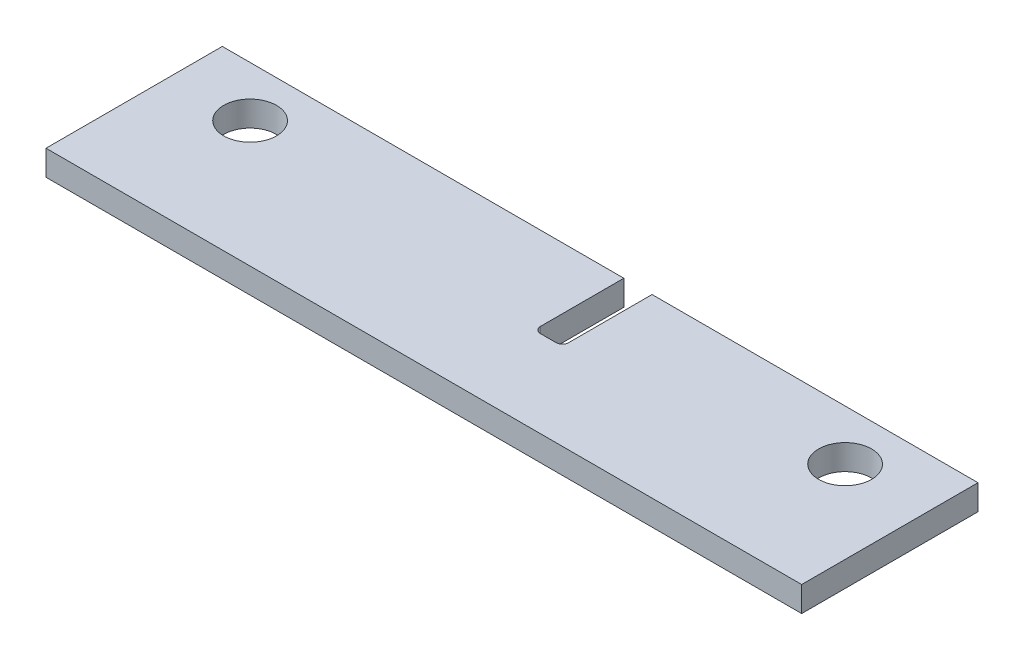
ISO-10303-21;
HEADER;
FILE_DESCRIPTION(('STEP AP214'),'2;1');
FILE_NAME('part.step','',(''),(''),'','','');
FILE_SCHEMA(('AUTOMOTIVE_DESIGN { 1 0 10303 214 1 1 1 1 }'));
ENDSEC;
DATA;
#1=APPLICATION_CONTEXT('core data for automotive mechanical design processes');
#2=APPLICATION_PROTOCOL_DEFINITION('international standard','automotive_design',2000,#1);
#3=PRODUCT_CONTEXT('',#1,'mechanical');
#4=PRODUCT('Part','Part','',(#3));
#5=PRODUCT_RELATED_PRODUCT_CATEGORY('part','',(#4));
#6=PRODUCT_DEFINITION_FORMATION('','',#4);
#7=PRODUCT_DEFINITION_CONTEXT('part definition',#1,'design');
#8=PRODUCT_DEFINITION('design','',#6,#7);
#9=PRODUCT_DEFINITION_SHAPE('','',#8);
#10=(LENGTH_UNIT() NAMED_UNIT(*) SI_UNIT(.MILLI.,.METRE.));
#11=(NAMED_UNIT(*) PLANE_ANGLE_UNIT() SI_UNIT($,.RADIAN.));
#12=(NAMED_UNIT(*) SI_UNIT($,.STERADIAN.) SOLID_ANGLE_UNIT());
#13=UNCERTAINTY_MEASURE_WITH_UNIT(LENGTH_MEASURE(1.E-05),#10,'distance_accuracy_value','');
#14=(GEOMETRIC_REPRESENTATION_CONTEXT(3) GLOBAL_UNCERTAINTY_ASSIGNED_CONTEXT((#13)) GLOBAL_UNIT_ASSIGNED_CONTEXT((#10,
#11,#12)) REPRESENTATION_CONTEXT('',''));
#15=CARTESIAN_POINT('',(0.,0.,0.));
#16=DIRECTION('',(0.,0.,1.));
#17=DIRECTION('',(1.,0.,0.));
#18=AXIS2_PLACEMENT_3D('',#15,#16,#17);
#19=CARTESIAN_POINT('',(0.,0.,249.6));
#20=DIRECTION('',(0.,0.,1.));
#21=DIRECTION('',(1.,0.,0.));
#22=AXIS2_PLACEMENT_3D('',#19,#20,#21);
#23=PLANE('',#22);
#24=DIRECTION('',(-1.,0.,0.));
#25=VECTOR('',#24,1.);
#26=CARTESIAN_POINT('',(2260.6,65.,249.6));
#27=LINE('',#26,#25);
#28=CARTESIAN_POINT('',(2463.038,65.,249.6));
#29=VERTEX_POINT('',#28);
#30=CARTESIAN_POINT('',(2260.6,65.,249.6));
#31=VERTEX_POINT('',#30);
#32=EDGE_CURVE('E127',#29,#31,#27,.T.);
#33=ORIENTED_EDGE('',*,*,#32,.F.);
#34=DIRECTION('',(0.,1.,0.));
#35=VECTOR('',#34,1.);
#36=CARTESIAN_POINT('',(2463.038,52.3,249.6));
#37=LINE('',#36,#35);
#38=CARTESIAN_POINT('',(2463.038,52.3,249.6));
#39=VERTEX_POINT('',#38);
#40=EDGE_CURVE('E194',#39,#29,#37,.T.);
#41=ORIENTED_EDGE('',*,*,#40,.F.);
#42=DIRECTION('',(1.,0.,0.));
#43=VECTOR('',#42,1.);
#44=CARTESIAN_POINT('',(2260.6,52.3,249.6));
#45=LINE('',#44,#43);
#46=CARTESIAN_POINT('',(2260.6,52.3,249.6));
#47=VERTEX_POINT('',#46);
#48=EDGE_CURVE('E152',#47,#39,#45,.T.);
#49=ORIENTED_EDGE('',*,*,#48,.F.);
#50=DIRECTION('',(0.,-1.,0.));
#51=VECTOR('',#50,1.);
#52=CARTESIAN_POINT('',(2260.6,65.,249.6));
#53=LINE('',#52,#51);
#54=EDGE_CURVE('E145',#31,#47,#53,.T.);
#55=ORIENTED_EDGE('',*,*,#54,.F.);
#56=EDGE_LOOP('',(#33,#41,#49,#55));
#57=FACE_BOUND('',#56,.T.);
#58=ADVANCED_FACE('F48',(#57),#23,.F.);
#59=CARTESIAN_POINT('',(2260.6,65.,249.6));
#60=DIRECTION('',(-1.,0.,0.));
#61=DIRECTION('',(0.,0.,1.));
#62=AXIS2_PLACEMENT_3D('',#59,#60,#61);
#63=PLANE('',#62);
#64=DIRECTION('',(0.,0.,1.));
#65=VECTOR('',#64,1.);
#66=CARTESIAN_POINT('',(2260.6,52.3,249.6));
#67=LINE('',#66,#65);
#68=CARTESIAN_POINT('',(2260.6,52.3,338.5));
#69=VERTEX_POINT('',#68);
#70=EDGE_CURVE('E155',#47,#69,#67,.T.);
#71=ORIENTED_EDGE('',*,*,#70,.T.);
#72=DIRECTION('',(0.,-1.,0.));
#73=VECTOR('',#72,1.);
#74=CARTESIAN_POINT('',(2260.6,65.,338.5));
#75=LINE('',#74,#73);
#76=CARTESIAN_POINT('',(2260.6,65.,338.5));
#77=VERTEX_POINT('',#76);
#78=EDGE_CURVE('E147',#77,#69,#75,.T.);
#79=ORIENTED_EDGE('',*,*,#78,.F.);
#80=DIRECTION('',(0.,0.,1.));
#81=VECTOR('',#80,1.);
#82=CARTESIAN_POINT('',(2260.6,65.,249.6));
#83=LINE('',#82,#81);
#84=EDGE_CURVE('E131',#31,#77,#83,.T.);
#85=ORIENTED_EDGE('',*,*,#84,.F.);
#86=ORIENTED_EDGE('',*,*,#54,.T.);
#87=EDGE_LOOP('',(#71,#79,#85,#86));
#88=FACE_BOUND('',#87,.T.);
#89=ADVANCED_FACE('F144',(#88),#63,.T.);
#90=CARTESIAN_POINT('',(2260.6,65.,249.6));
#91=DIRECTION('',(0.,1.,0.));
#92=DIRECTION('',(0.,0.,1.));
#93=AXIS2_PLACEMENT_3D('',#90,#91,#92);
#94=PLANE('',#93);
#95=CARTESIAN_POINT('',(2599.99999999996,65.,275.));
#96=DIRECTION('',(0.,1.,0.));
#97=DIRECTION('',(0.,0.,1.));
#98=AXIS2_PLACEMENT_3D('',#95,#96,#97);
#99=CIRCLE('',#98,13.3349999999999);
#100=CARTESIAN_POINT('',(2599.99999999996,64.9999999999999,261.665));
#101=VERTEX_POINT('',#100);
#102=EDGE_CURVE('E154',#101,#101,#99,.F.);
#103=ORIENTED_EDGE('',*,*,#102,.T.);
#104=EDGE_LOOP('',(#103));
#105=FACE_BOUND('',#104,.T.);
#106=CARTESIAN_POINT('',(2299.99999999996,65.,275.));
#107=DIRECTION('',(0.,1.,0.));
#108=DIRECTION('',(0.,0.,1.));
#109=AXIS2_PLACEMENT_3D('',#106,#107,#108);
#110=CIRCLE('',#109,13.3349999999999);
#111=CARTESIAN_POINT('',(2299.99999999996,65.,261.665));
#112=VERTEX_POINT('',#111);
#113=EDGE_CURVE('E138',#112,#112,#110,.F.);
#114=ORIENTED_EDGE('',*,*,#113,.T.);
#115=EDGE_LOOP('',(#114));
#116=FACE_BOUND('',#115,.T.);
#117=DIRECTION('',(0.,0.,1.));
#118=VECTOR('',#117,1.);
#119=CARTESIAN_POINT('',(2463.038,65.,249.6));
#120=LINE('',#119,#118);
#121=CARTESIAN_POINT('',(2463.038,65.,291.637));
#122=VERTEX_POINT('',#121);
#123=EDGE_CURVE('E133',#29,#122,#120,.T.);
#124=ORIENTED_EDGE('',*,*,#123,.F.);
#125=ORIENTED_EDGE('',*,*,#32,.T.);
#126=ORIENTED_EDGE('',*,*,#84,.T.);
#127=DIRECTION('',(-1.,0.,0.));
#128=VECTOR('',#127,1.);
#129=CARTESIAN_POINT('',(2260.6,65.,338.5));
#130=LINE('',#129,#128);
#131=CARTESIAN_POINT('',(2641.6,65.,338.5));
#132=VERTEX_POINT('',#131);
#133=EDGE_CURVE('E165',#132,#77,#130,.T.);
#134=ORIENTED_EDGE('',*,*,#133,.F.);
#135=DIRECTION('',(0.,0.,1.));
#136=VECTOR('',#135,1.);
#137=CARTESIAN_POINT('',(2641.6,65.,249.6));
#138=LINE('',#137,#136);
#139=CARTESIAN_POINT('',(2641.6,65.,249.6));
#140=VERTEX_POINT('',#139);
#141=EDGE_CURVE('E244',#140,#132,#138,.T.);
#142=ORIENTED_EDGE('',*,*,#141,.F.);
#143=CARTESIAN_POINT('',(2477.262,65.,249.6));
#144=VERTEX_POINT('',#143);
#145=EDGE_CURVE('E140',#140,#144,#27,.T.);
#146=ORIENTED_EDGE('',*,*,#145,.T.);
#147=DIRECTION('',(0.,0.,-1.));
#148=VECTOR('',#147,1.);
#149=CARTESIAN_POINT('',(2477.262,65.,249.6));
#150=LINE('',#149,#148);
#151=CARTESIAN_POINT('',(2477.262,65.,291.637));
#152=VERTEX_POINT('',#151);
#153=EDGE_CURVE('E197',#152,#144,#150,.T.);
#154=ORIENTED_EDGE('',*,*,#153,.F.);
#155=CARTESIAN_POINT('',(2474.087,65.,291.637));
#156=DIRECTION('',(0.,1.,0.));
#157=DIRECTION('',(0.,0.,1.));
#158=AXIS2_PLACEMENT_3D('',#155,#156,#157);
#159=CIRCLE('',#158,3.175);
#160=CARTESIAN_POINT('',(2474.087,65.,294.812));
#161=VERTEX_POINT('',#160);
#162=EDGE_CURVE('E230',#152,#161,#159,.F.);
#163=ORIENTED_EDGE('',*,*,#162,.T.);
#164=DIRECTION('',(1.,0.,0.));
#165=VECTOR('',#164,1.);
#166=CARTESIAN_POINT('',(2260.6,65.,294.812));
#167=LINE('',#166,#165);
#168=CARTESIAN_POINT('',(2466.213,65.,294.812));
#169=VERTEX_POINT('',#168);
#170=EDGE_CURVE('E213',#169,#161,#167,.T.);
#171=ORIENTED_EDGE('',*,*,#170,.F.);
#172=CARTESIAN_POINT('',(2466.213,65.,291.637));
#173=DIRECTION('',(0.,1.,0.));
#174=DIRECTION('',(0.,0.,1.));
#175=AXIS2_PLACEMENT_3D('',#172,#173,#174);
#176=CIRCLE('',#175,3.175);
#177=EDGE_CURVE('E57',#169,#122,#176,.F.);
#178=ORIENTED_EDGE('',*,*,#177,.T.);
#179=EDGE_LOOP('',(#124,#125,#126,#134,#142,#146,#154,#163,#171,#178));
#180=FACE_BOUND('',#179,.T.);
#181=ADVANCED_FACE('F129',(#105,#116,#180),#94,.T.);
#182=CARTESIAN_POINT('',(2641.6,65.,249.6));
#183=DIRECTION('',(1.,0.,0.));
#184=DIRECTION('',(0.,0.,-1.));
#185=AXIS2_PLACEMENT_3D('',#182,#183,#184);
#186=PLANE('',#185);
#187=ORIENTED_EDGE('',*,*,#141,.T.);
#188=DIRECTION('',(0.,1.,0.));
#189=VECTOR('',#188,1.);
#190=CARTESIAN_POINT('',(2641.6,65.,338.5));
#191=LINE('',#190,#189);
#192=CARTESIAN_POINT('',(2641.6,52.3,338.5));
#193=VERTEX_POINT('',#192);
#194=EDGE_CURVE('E168',#193,#132,#191,.T.);
#195=ORIENTED_EDGE('',*,*,#194,.F.);
#196=DIRECTION('',(0.,0.,1.));
#197=VECTOR('',#196,1.);
#198=CARTESIAN_POINT('',(2641.6,52.3,249.6));
#199=LINE('',#198,#197);
#200=CARTESIAN_POINT('',(2641.6,52.3,249.6));
#201=VERTEX_POINT('',#200);
#202=EDGE_CURVE('E238',#201,#193,#199,.T.);
#203=ORIENTED_EDGE('',*,*,#202,.F.);
#204=DIRECTION('',(0.,1.,0.));
#205=VECTOR('',#204,1.);
#206=CARTESIAN_POINT('',(2641.6,65.,249.6));
#207=LINE('',#206,#205);
#208=EDGE_CURVE('E184',#201,#140,#207,.T.);
#209=ORIENTED_EDGE('',*,*,#208,.T.);
#210=EDGE_LOOP('',(#187,#195,#203,#209));
#211=FACE_BOUND('',#210,.T.);
#212=ADVANCED_FACE('F295',(#211),#186,.T.);
#213=CARTESIAN_POINT('',(2260.6,52.3,249.6));
#214=DIRECTION('',(0.,-1.,0.));
#215=DIRECTION('',(0.,0.,-1.));
#216=AXIS2_PLACEMENT_3D('',#213,#214,#215);
#217=PLANE('',#216);
#218=CARTESIAN_POINT('',(2599.99999999996,52.3,275.));
#219=DIRECTION('',(0.,-1.,0.));
#220=DIRECTION('',(0.,0.,-1.));
#221=AXIS2_PLACEMENT_3D('',#218,#219,#220);
#222=CIRCLE('',#221,13.3349999999999);
#223=CARTESIAN_POINT('',(2599.99999999996,52.3,261.665));
#224=VERTEX_POINT('',#223);
#225=EDGE_CURVE('E179',#224,#224,#222,.F.);
#226=ORIENTED_EDGE('',*,*,#225,.T.);
#227=EDGE_LOOP('',(#226));
#228=FACE_BOUND('',#227,.T.);
#229=CARTESIAN_POINT('',(2299.99999999996,52.3,275.));
#230=DIRECTION('',(0.,-1.,0.));
#231=DIRECTION('',(0.,0.,-1.));
#232=AXIS2_PLACEMENT_3D('',#229,#230,#231);
#233=CIRCLE('',#232,13.3349999999999);
#234=CARTESIAN_POINT('',(2299.99999999996,52.3,261.665));
#235=VERTEX_POINT('',#234);
#236=EDGE_CURVE('E183',#235,#235,#233,.F.);
#237=ORIENTED_EDGE('',*,*,#236,.T.);
#238=EDGE_LOOP('',(#237));
#239=FACE_BOUND('',#238,.T.);
#240=DIRECTION('',(0.,0.,1.));
#241=VECTOR('',#240,1.);
#242=CARTESIAN_POINT('',(2463.038,52.3,249.6));
#243=LINE('',#242,#241);
#244=CARTESIAN_POINT('',(2463.038,52.3,291.637));
#245=VERTEX_POINT('',#244);
#246=EDGE_CURVE('E191',#39,#245,#243,.T.);
#247=ORIENTED_EDGE('',*,*,#246,.T.);
#248=CARTESIAN_POINT('',(2466.213,52.3,291.637));
#249=DIRECTION('',(0.,-1.,0.));
#250=DIRECTION('',(0.,0.,-1.));
#251=AXIS2_PLACEMENT_3D('',#248,#249,#250);
#252=CIRCLE('',#251,3.175);
#253=CARTESIAN_POINT('',(2466.213,52.3,294.812));
#254=VERTEX_POINT('',#253);
#255=EDGE_CURVE('E12',#245,#254,#252,.F.);
#256=ORIENTED_EDGE('',*,*,#255,.T.);
#257=DIRECTION('',(1.,0.,0.));
#258=VECTOR('',#257,1.);
#259=CARTESIAN_POINT('',(2463.8,52.3,294.812));
#260=LINE('',#259,#258);
#261=CARTESIAN_POINT('',(2474.087,52.3,294.812));
#262=VERTEX_POINT('',#261);
#263=EDGE_CURVE('E200',#254,#262,#260,.T.);
#264=ORIENTED_EDGE('',*,*,#263,.T.);
#265=CARTESIAN_POINT('',(2474.087,52.3,291.637));
#266=DIRECTION('',(0.,-1.,0.));
#267=DIRECTION('',(0.,0.,-1.));
#268=AXIS2_PLACEMENT_3D('',#265,#266,#267);
#269=CIRCLE('',#268,3.175);
#270=CARTESIAN_POINT('',(2477.262,52.3,291.637));
#271=VERTEX_POINT('',#270);
#272=EDGE_CURVE('E233',#262,#271,#269,.F.);
#273=ORIENTED_EDGE('',*,*,#272,.T.);
#274=DIRECTION('',(0.,0.,-1.));
#275=VECTOR('',#274,1.);
#276=CARTESIAN_POINT('',(2477.262,52.3,249.6));
#277=LINE('',#276,#275);
#278=CARTESIAN_POINT('',(2477.262,52.3,249.6));
#279=VERTEX_POINT('',#278);
#280=EDGE_CURVE('E204',#271,#279,#277,.T.);
#281=ORIENTED_EDGE('',*,*,#280,.T.);
#282=EDGE_CURVE('E207',#279,#201,#45,.T.);
#283=ORIENTED_EDGE('',*,*,#282,.T.);
#284=ORIENTED_EDGE('',*,*,#202,.T.);
#285=DIRECTION('',(1.,0.,0.));
#286=VECTOR('',#285,1.);
#287=CARTESIAN_POINT('',(2260.6,52.3,338.5));
#288=LINE('',#287,#286);
#289=EDGE_CURVE('E172',#69,#193,#288,.T.);
#290=ORIENTED_EDGE('',*,*,#289,.F.);
#291=ORIENTED_EDGE('',*,*,#70,.F.);
#292=ORIENTED_EDGE('',*,*,#48,.T.);
#293=EDGE_LOOP('',(#247,#256,#264,#273,#281,#283,#284,#290,#291,#292));
#294=FACE_BOUND('',#293,.T.);
#295=ADVANCED_FACE('F270',(#228,#239,#294),#217,.T.);
#296=ORIENTED_EDGE('',*,*,#282,.F.);
#297=DIRECTION('',(0.,1.,0.));
#298=VECTOR('',#297,1.);
#299=CARTESIAN_POINT('',(2477.262,0.,249.6));
#300=LINE('',#299,#298);
#301=EDGE_CURVE('E177',#279,#144,#300,.T.);
#302=ORIENTED_EDGE('',*,*,#301,.T.);
#303=ORIENTED_EDGE('',*,*,#145,.F.);
#304=ORIENTED_EDGE('',*,*,#208,.F.);
#305=EDGE_LOOP('',(#296,#302,#303,#304));
#306=FACE_BOUND('',#305,.T.);
#307=ADVANCED_FACE('F253',(#306),#23,.F.);
#308=CARTESIAN_POINT('',(0.,0.,338.5));
#309=DIRECTION('',(0.,0.,1.));
#310=DIRECTION('',(1.,0.,0.));
#311=AXIS2_PLACEMENT_3D('',#308,#309,#310);
#312=PLANE('',#311);
#313=ORIENTED_EDGE('',*,*,#78,.T.);
#314=ORIENTED_EDGE('',*,*,#289,.T.);
#315=ORIENTED_EDGE('',*,*,#194,.T.);
#316=ORIENTED_EDGE('',*,*,#133,.T.);
#317=EDGE_LOOP('',(#313,#314,#315,#316));
#318=FACE_BOUND('',#317,.T.);
#319=ADVANCED_FACE('F273',(#318),#312,.T.);
#320=CARTESIAN_POINT('',(2463.038,52.3,249.6));
#321=DIRECTION('',(-1.,0.,0.));
#322=DIRECTION('',(0.,0.,1.));
#323=AXIS2_PLACEMENT_3D('',#320,#321,#322);
#324=PLANE('',#323);
#325=ORIENTED_EDGE('',*,*,#123,.T.);
#326=DIRECTION('',(0.,1.,0.));
#327=VECTOR('',#326,1.);
#328=CARTESIAN_POINT('',(2463.038,52.3,291.637));
#329=LINE('',#328,#327);
#330=EDGE_CURVE('E67',#122,#245,#329,.F.);
#331=ORIENTED_EDGE('',*,*,#330,.T.);
#332=ORIENTED_EDGE('',*,*,#246,.F.);
#333=ORIENTED_EDGE('',*,*,#40,.T.);
#334=EDGE_LOOP('',(#325,#331,#332,#333));
#335=FACE_BOUND('',#334,.T.);
#336=ADVANCED_FACE('F271',(#335),#324,.F.);
#337=CARTESIAN_POINT('',(2477.262,52.3,249.6));
#338=DIRECTION('',(1.,0.,0.));
#339=DIRECTION('',(0.,0.,-1.));
#340=AXIS2_PLACEMENT_3D('',#337,#338,#339);
#341=PLANE('',#340);
#342=ORIENTED_EDGE('',*,*,#280,.F.);
#343=DIRECTION('',(0.,1.,0.));
#344=VECTOR('',#343,1.);
#345=CARTESIAN_POINT('',(2477.262,65.,291.637));
#346=LINE('',#345,#344);
#347=EDGE_CURVE('E217',#271,#152,#346,.T.);
#348=ORIENTED_EDGE('',*,*,#347,.T.);
#349=ORIENTED_EDGE('',*,*,#153,.T.);
#350=ORIENTED_EDGE('',*,*,#301,.F.);
#351=EDGE_LOOP('',(#342,#348,#349,#350));
#352=FACE_BOUND('',#351,.T.);
#353=ADVANCED_FACE('F257',(#352),#341,.F.);
#354=CARTESIAN_POINT('',(2463.8,52.3,294.812));
#355=DIRECTION('',(0.,0.,1.));
#356=DIRECTION('',(1.,0.,0.));
#357=AXIS2_PLACEMENT_3D('',#354,#355,#356);
#358=PLANE('',#357);
#359=ORIENTED_EDGE('',*,*,#170,.T.);
#360=DIRECTION('',(0.,1.,0.));
#361=VECTOR('',#360,1.);
#362=CARTESIAN_POINT('',(2474.087,52.3,294.812));
#363=LINE('',#362,#361);
#364=EDGE_CURVE('E225',#161,#262,#363,.F.);
#365=ORIENTED_EDGE('',*,*,#364,.T.);
#366=ORIENTED_EDGE('',*,*,#263,.F.);
#367=DIRECTION('',(0.,1.,0.));
#368=VECTOR('',#367,1.);
#369=CARTESIAN_POINT('',(2466.213,65.,294.812));
#370=LINE('',#369,#368);
#371=EDGE_CURVE('E221',#254,#169,#370,.T.);
#372=ORIENTED_EDGE('',*,*,#371,.T.);
#373=EDGE_LOOP('',(#359,#365,#366,#372));
#374=FACE_BOUND('',#373,.T.);
#375=ADVANCED_FACE('F264',(#374),#358,.F.);
#376=CARTESIAN_POINT('',(2299.99999999996,181.249999999996,275.));
#377=DIRECTION('',(0.,-1.,0.));
#378=DIRECTION('',(0.,0.,-1.));
#379=AXIS2_PLACEMENT_3D('',#376,#377,#378);
#380=CYLINDRICAL_SURFACE('',#379,13.3349999999999);
#381=CARTESIAN_POINT('',(2299.99999999996,65.,261.665));
#382=CARTESIAN_POINT('',(2299.99999999996,64.8677083333333,261.665));
#383=CARTESIAN_POINT('',(2299.99999999996,64.7354166666666,261.665));
#384=CARTESIAN_POINT('',(2299.99999999996,64.4708333333333,261.665));
#385=CARTESIAN_POINT('',(2299.99999999996,64.3385416666666,261.665));
#386=CARTESIAN_POINT('',(2299.99999999996,64.0739583333333,261.665));
#387=CARTESIAN_POINT('',(2299.99999999996,63.9416666666666,261.665));
#388=CARTESIAN_POINT('',(2299.99999999996,63.6770833333333,261.665));
#389=CARTESIAN_POINT('',(2299.99999999996,63.5447916666666,261.665));
#390=CARTESIAN_POINT('',(2299.99999999996,63.2802083333333,261.665));
#391=CARTESIAN_POINT('',(2299.99999999996,63.1479166666666,261.665));
#392=CARTESIAN_POINT('',(2299.99999999996,62.8833333333333,261.665));
#393=CARTESIAN_POINT('',(2299.99999999996,62.7510416666666,261.665));
#394=CARTESIAN_POINT('',(2299.99999999996,62.4864583333333,261.665));
#395=CARTESIAN_POINT('',(2299.99999999996,62.3541666666666,261.665));
#396=CARTESIAN_POINT('',(2299.99999999996,62.0895833333333,261.665));
#397=CARTESIAN_POINT('',(2299.99999999996,61.9572916666666,261.665));
#398=CARTESIAN_POINT('',(2299.99999999996,61.6927083333333,261.665));
#399=CARTESIAN_POINT('',(2299.99999999996,61.5604166666666,261.665));
#400=CARTESIAN_POINT('',(2299.99999999996,61.2958333333333,261.665));
#401=CARTESIAN_POINT('',(2299.99999999996,61.1635416666666,261.665));
#402=CARTESIAN_POINT('',(2299.99999999996,60.8989583333333,261.665));
#403=CARTESIAN_POINT('',(2299.99999999996,60.7666666666666,261.665));
#404=CARTESIAN_POINT('',(2299.99999999996,60.5020833333333,261.665));
#405=CARTESIAN_POINT('',(2299.99999999996,60.3697916666666,261.665));
#406=CARTESIAN_POINT('',(2299.99999999996,60.1052083333333,261.665));
#407=CARTESIAN_POINT('',(2299.99999999996,59.9729166666666,261.665));
#408=CARTESIAN_POINT('',(2299.99999999996,59.7083333333333,261.665));
#409=CARTESIAN_POINT('',(2299.99999999996,59.5760416666666,261.665));
#410=CARTESIAN_POINT('',(2299.99999999996,59.3114583333333,261.665));
#411=CARTESIAN_POINT('',(2299.99999999996,59.1791666666666,261.665));
#412=CARTESIAN_POINT('',(2299.99999999996,58.9145833333333,261.665));
#413=CARTESIAN_POINT('',(2299.99999999996,58.7822916666666,261.665));
#414=CARTESIAN_POINT('',(2299.99999999996,58.5177083333333,261.665));
#415=CARTESIAN_POINT('',(2299.99999999996,58.3854166666666,261.665));
#416=CARTESIAN_POINT('',(2299.99999999996,58.1208333333333,261.665));
#417=CARTESIAN_POINT('',(2299.99999999996,57.9885416666666,261.665));
#418=CARTESIAN_POINT('',(2299.99999999996,57.7239583333333,261.665));
#419=CARTESIAN_POINT('',(2299.99999999996,57.5916666666666,261.665));
#420=CARTESIAN_POINT('',(2299.99999999996,57.3270833333333,261.665));
#421=CARTESIAN_POINT('',(2299.99999999996,57.1947916666666,261.665));
#422=CARTESIAN_POINT('',(2299.99999999996,56.9302083333333,261.665));
#423=CARTESIAN_POINT('',(2299.99999999996,56.7979166666666,261.665));
#424=CARTESIAN_POINT('',(2299.99999999996,56.5333333333333,261.665));
#425=CARTESIAN_POINT('',(2299.99999999996,56.4010416666666,261.665));
#426=CARTESIAN_POINT('',(2299.99999999996,56.1364583333333,261.665));
#427=CARTESIAN_POINT('',(2299.99999999996,56.0041666666666,261.665));
#428=CARTESIAN_POINT('',(2299.99999999996,55.7395833333333,261.665));
#429=CARTESIAN_POINT('',(2299.99999999996,55.6072916666666,261.665));
#430=CARTESIAN_POINT('',(2299.99999999996,55.3427083333333,261.665));
#431=CARTESIAN_POINT('',(2299.99999999996,55.2104166666666,261.665));
#432=CARTESIAN_POINT('',(2299.99999999996,54.9458333333333,261.665));
#433=CARTESIAN_POINT('',(2299.99999999996,54.8135416666666,261.665));
#434=CARTESIAN_POINT('',(2299.99999999996,54.5489583333333,261.665));
#435=CARTESIAN_POINT('',(2299.99999999996,54.4166666666666,261.665));
#436=CARTESIAN_POINT('',(2299.99999999996,54.1520833333333,261.665));
#437=CARTESIAN_POINT('',(2299.99999999996,54.0197916666666,261.665));
#438=CARTESIAN_POINT('',(2299.99999999996,53.7552083333333,261.665));
#439=CARTESIAN_POINT('',(2299.99999999996,53.6229166666666,261.665));
#440=CARTESIAN_POINT('',(2299.99999999996,53.3583333333333,261.665));
#441=CARTESIAN_POINT('',(2299.99999999996,53.2260416666666,261.665));
#442=CARTESIAN_POINT('',(2299.99999999996,52.9614583333333,261.665));
#443=CARTESIAN_POINT('',(2299.99999999996,52.8291666666666,261.665));
#444=CARTESIAN_POINT('',(2299.99999999996,52.5645833333333,261.665));
#445=CARTESIAN_POINT('',(2299.99999999996,52.4322916666666,261.665));
#446=CARTESIAN_POINT('',(2299.99999999996,52.3,261.665));
#447=B_SPLINE_CURVE_WITH_KNOTS('',3,(#381,#382,#383,#384,#385,#386,#387,#388,#389,#390,#391,
#392,#393,#394,#395,#396,#397,#398,#399,#400,#401,#402,#403,#404,#405,#406,#407,#408,#409,#410,
#411,#412,#413,#414,#415,#416,#417,#418,#419,#420,#421,#422,#423,#424,#425,#426,#427,#428,#429,
#430,#431,#432,#433,#434,#435,#436,#437,#438,#439,#440,#441,#442,#443,#444,#445,#446),
.UNSPECIFIED.,.F.,.F.,(4,2,2,2,2,2,2,2,2,2,2,2,2,2,2,2,2,2,2,2,2,2,2,2,2,2,2,2,2,2,2,2,4),(0.,
0.396875000000005,0.793749999999996,1.190625,1.58750000000001,1.984375,2.38125,2.77812500000001,
3.17500000000001,3.571875,3.96875000000001,4.36562500000001,4.7625,5.15937500000001,
5.55625000000001,5.953125,6.35000000000001,6.74687500000001,7.14375,7.54062500000001,
7.93750000000001,8.334375,8.73125000000001,9.12812500000001,9.52500000000001,9.92187500000002,
10.31875,10.715625,11.1125,11.509375,11.90625,12.303125,12.7),.UNSPECIFIED.);
#448=EDGE_CURVE('BSEAM309',#112,#235,#447,.T.);
#449=ORIENTED_EDGE('',*,*,#113,.F.);
#450=ORIENTED_EDGE('',*,*,#236,.F.);
#451=ORIENTED_EDGE('',*,*,#448,.T.);
#452=ORIENTED_EDGE('',*,*,#448,.F.);
#453=EDGE_LOOP('',(#449,#451,#450,#452));
#454=FACE_BOUND('',#453,.T.);
#455=ADVANCED_FACE('F309',(#454),#380,.F.);
#456=CARTESIAN_POINT('',(2599.99999999996,289.999999999996,275.));
#457=DIRECTION('',(0.,-1.,0.));
#458=DIRECTION('',(0.,0.,-1.));
#459=AXIS2_PLACEMENT_3D('',#456,#457,#458);
#460=CYLINDRICAL_SURFACE('',#459,13.3349999999999);
#461=CARTESIAN_POINT('',(2599.99999999996,64.9999999999999,261.665));
#462=CARTESIAN_POINT('',(2599.99999999996,64.8677083333333,261.665));
#463=CARTESIAN_POINT('',(2599.99999999996,64.7354166666666,261.665));
#464=CARTESIAN_POINT('',(2599.99999999996,64.4708333333333,261.665));
#465=CARTESIAN_POINT('',(2599.99999999996,64.3385416666666,261.665));
#466=CARTESIAN_POINT('',(2599.99999999996,64.0739583333333,261.665));
#467=CARTESIAN_POINT('',(2599.99999999996,63.9416666666666,261.665));
#468=CARTESIAN_POINT('',(2599.99999999996,63.6770833333333,261.665));
#469=CARTESIAN_POINT('',(2599.99999999996,63.5447916666666,261.665));
#470=CARTESIAN_POINT('',(2599.99999999996,63.2802083333333,261.665));
#471=CARTESIAN_POINT('',(2599.99999999996,63.1479166666666,261.665));
#472=CARTESIAN_POINT('',(2599.99999999996,62.8833333333333,261.665));
#473=CARTESIAN_POINT('',(2599.99999999996,62.7510416666666,261.665));
#474=CARTESIAN_POINT('',(2599.99999999996,62.4864583333333,261.665));
#475=CARTESIAN_POINT('',(2599.99999999996,62.3541666666666,261.665));
#476=CARTESIAN_POINT('',(2599.99999999996,62.0895833333333,261.665));
#477=CARTESIAN_POINT('',(2599.99999999996,61.9572916666666,261.665));
#478=CARTESIAN_POINT('',(2599.99999999996,61.6927083333333,261.665));
#479=CARTESIAN_POINT('',(2599.99999999996,61.5604166666666,261.665));
#480=CARTESIAN_POINT('',(2599.99999999996,61.2958333333333,261.665));
#481=CARTESIAN_POINT('',(2599.99999999996,61.1635416666666,261.665));
#482=CARTESIAN_POINT('',(2599.99999999996,60.8989583333333,261.665));
#483=CARTESIAN_POINT('',(2599.99999999996,60.7666666666666,261.665));
#484=CARTESIAN_POINT('',(2599.99999999996,60.5020833333333,261.665));
#485=CARTESIAN_POINT('',(2599.99999999996,60.3697916666666,261.665));
#486=CARTESIAN_POINT('',(2599.99999999996,60.1052083333333,261.665));
#487=CARTESIAN_POINT('',(2599.99999999996,59.9729166666666,261.665));
#488=CARTESIAN_POINT('',(2599.99999999996,59.7083333333333,261.665));
#489=CARTESIAN_POINT('',(2599.99999999996,59.5760416666666,261.665));
#490=CARTESIAN_POINT('',(2599.99999999996,59.3114583333333,261.665));
#491=CARTESIAN_POINT('',(2599.99999999996,59.1791666666666,261.665));
#492=CARTESIAN_POINT('',(2599.99999999996,58.9145833333333,261.665));
#493=CARTESIAN_POINT('',(2599.99999999996,58.7822916666666,261.665));
#494=CARTESIAN_POINT('',(2599.99999999996,58.5177083333333,261.665));
#495=CARTESIAN_POINT('',(2599.99999999996,58.3854166666666,261.665));
#496=CARTESIAN_POINT('',(2599.99999999996,58.1208333333333,261.665));
#497=CARTESIAN_POINT('',(2599.99999999996,57.9885416666666,261.665));
#498=CARTESIAN_POINT('',(2599.99999999996,57.7239583333333,261.665));
#499=CARTESIAN_POINT('',(2599.99999999996,57.5916666666666,261.665));
#500=CARTESIAN_POINT('',(2599.99999999996,57.3270833333333,261.665));
#501=CARTESIAN_POINT('',(2599.99999999996,57.1947916666666,261.665));
#502=CARTESIAN_POINT('',(2599.99999999996,56.9302083333333,261.665));
#503=CARTESIAN_POINT('',(2599.99999999996,56.7979166666666,261.665));
#504=CARTESIAN_POINT('',(2599.99999999996,56.5333333333333,261.665));
#505=CARTESIAN_POINT('',(2599.99999999996,56.4010416666666,261.665));
#506=CARTESIAN_POINT('',(2599.99999999996,56.1364583333333,261.665));
#507=CARTESIAN_POINT('',(2599.99999999996,56.0041666666666,261.665));
#508=CARTESIAN_POINT('',(2599.99999999996,55.7395833333333,261.665));
#509=CARTESIAN_POINT('',(2599.99999999996,55.6072916666666,261.665));
#510=CARTESIAN_POINT('',(2599.99999999996,55.3427083333333,261.665));
#511=CARTESIAN_POINT('',(2599.99999999996,55.2104166666666,261.665));
#512=CARTESIAN_POINT('',(2599.99999999996,54.9458333333333,261.665));
#513=CARTESIAN_POINT('',(2599.99999999996,54.8135416666666,261.665));
#514=CARTESIAN_POINT('',(2599.99999999996,54.5489583333333,261.665));
#515=CARTESIAN_POINT('',(2599.99999999996,54.4166666666666,261.665));
#516=CARTESIAN_POINT('',(2599.99999999996,54.1520833333333,261.665));
#517=CARTESIAN_POINT('',(2599.99999999996,54.0197916666666,261.665));
#518=CARTESIAN_POINT('',(2599.99999999996,53.7552083333333,261.665));
#519=CARTESIAN_POINT('',(2599.99999999996,53.6229166666666,261.665));
#520=CARTESIAN_POINT('',(2599.99999999996,53.3583333333333,261.665));
#521=CARTESIAN_POINT('',(2599.99999999996,53.2260416666666,261.665));
#522=CARTESIAN_POINT('',(2599.99999999996,52.9614583333333,261.665));
#523=CARTESIAN_POINT('',(2599.99999999996,52.8291666666666,261.665));
#524=CARTESIAN_POINT('',(2599.99999999996,52.5645833333333,261.665));
#525=CARTESIAN_POINT('',(2599.99999999996,52.4322916666666,261.665));
#526=CARTESIAN_POINT('',(2599.99999999996,52.3,261.665));
#527=B_SPLINE_CURVE_WITH_KNOTS('',3,(#461,#462,#463,#464,#465,#466,#467,#468,#469,#470,#471,
#472,#473,#474,#475,#476,#477,#478,#479,#480,#481,#482,#483,#484,#485,#486,#487,#488,#489,#490,
#491,#492,#493,#494,#495,#496,#497,#498,#499,#500,#501,#502,#503,#504,#505,#506,#507,#508,#509,
#510,#511,#512,#513,#514,#515,#516,#517,#518,#519,#520,#521,#522,#523,#524,#525,#526),
.UNSPECIFIED.,.F.,.F.,(4,2,2,2,2,2,2,2,2,2,2,2,2,2,2,2,2,2,2,2,2,2,2,2,2,2,2,2,2,2,2,2,4),(0.,
0.396874999999991,0.79375000000001,1.190625,1.58749999999999,1.98437500000001,2.38125,
2.77812499999999,3.17499999999998,3.571875,3.96874999999999,4.36562499999998,4.7625,
5.15937499999999,5.55624999999998,5.953125,6.34999999999999,6.74687499999999,7.14375,7.540625,
7.93749999999999,8.334375,8.73125,9.12812499999999,9.52500000000001,9.921875,10.31875,10.715625,
11.1125,11.509375,11.90625,12.303125,12.7),.UNSPECIFIED.);
#528=EDGE_CURVE('BSEAM307',#101,#224,#527,.T.);
#529=ORIENTED_EDGE('',*,*,#102,.F.);
#530=ORIENTED_EDGE('',*,*,#225,.F.);
#531=ORIENTED_EDGE('',*,*,#528,.T.);
#532=ORIENTED_EDGE('',*,*,#528,.F.);
#533=EDGE_LOOP('',(#529,#531,#530,#532));
#534=FACE_BOUND('',#533,.T.);
#535=ADVANCED_FACE('F307',(#534),#460,.F.);
#536=CARTESIAN_POINT('',(2474.087,52.3,291.637));
#537=DIRECTION('',(0.,-1.,0.));
#538=DIRECTION('',(0.,0.,-1.));
#539=AXIS2_PLACEMENT_3D('',#536,#537,#538);
#540=CYLINDRICAL_SURFACE('',#539,3.175);
#541=ORIENTED_EDGE('',*,*,#272,.F.);
#542=ORIENTED_EDGE('',*,*,#364,.F.);
#543=ORIENTED_EDGE('',*,*,#162,.F.);
#544=ORIENTED_EDGE('',*,*,#347,.F.);
#545=EDGE_LOOP('',(#541,#542,#543,#544));
#546=FACE_BOUND('',#545,.T.);
#547=ADVANCED_FACE('F261',(#546),#540,.F.);
#548=CARTESIAN_POINT('',(2466.213,52.3,291.637));
#549=DIRECTION('',(0.,-1.,0.));
#550=DIRECTION('',(0.,0.,-1.));
#551=AXIS2_PLACEMENT_3D('',#548,#549,#550);
#552=CYLINDRICAL_SURFACE('',#551,3.175);
#553=ORIENTED_EDGE('',*,*,#255,.F.);
#554=ORIENTED_EDGE('',*,*,#330,.F.);
#555=ORIENTED_EDGE('',*,*,#177,.F.);
#556=ORIENTED_EDGE('',*,*,#371,.F.);
#557=EDGE_LOOP('',(#553,#554,#555,#556));
#558=FACE_BOUND('',#557,.T.);
#559=ADVANCED_FACE('F50',(#558),#552,.F.);
#560=CLOSED_SHELL('',(#58,#89,#181,#212,#295,#307,#319,#336,#353,#375,#455,#535,#547,#559));
#561=MANIFOLD_SOLID_BREP('B2',#560);
#562=ADVANCED_BREP_SHAPE_REPRESENTATION('',(#18,#561),#14);
#563=SHAPE_DEFINITION_REPRESENTATION(#9,#562);
ENDSEC;
END-ISO-10303-21;
